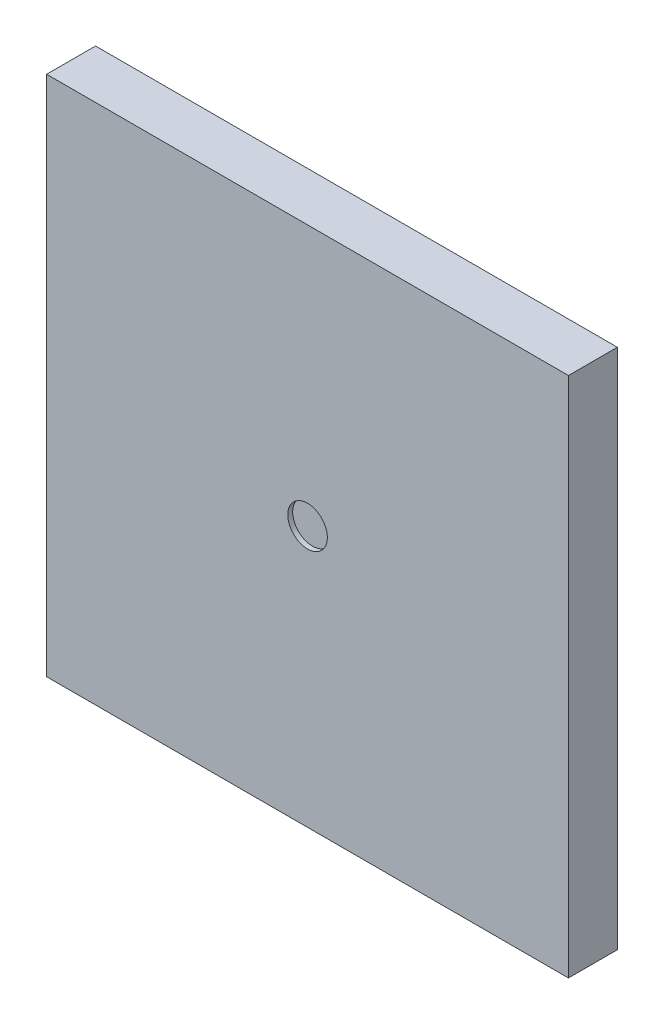
ISO-10303-21;
HEADER;
FILE_DESCRIPTION(('STEP AP214'),'2;1');
FILE_NAME('part.step','',(''),(''),'','','');
FILE_SCHEMA(('AUTOMOTIVE_DESIGN { 1 0 10303 214 1 1 1 1 }'));
ENDSEC;
DATA;
#1=APPLICATION_CONTEXT('core data for automotive mechanical design processes');
#2=APPLICATION_PROTOCOL_DEFINITION('international standard','automotive_design',2000,#1);
#3=PRODUCT_CONTEXT('',#1,'mechanical');
#4=PRODUCT('Part','Part','',(#3));
#5=PRODUCT_RELATED_PRODUCT_CATEGORY('part','',(#4));
#6=PRODUCT_DEFINITION_FORMATION('','',#4);
#7=PRODUCT_DEFINITION_CONTEXT('part definition',#1,'design');
#8=PRODUCT_DEFINITION('design','',#6,#7);
#9=PRODUCT_DEFINITION_SHAPE('','',#8);
#10=(LENGTH_UNIT() NAMED_UNIT(*) SI_UNIT(.MILLI.,.METRE.));
#11=(NAMED_UNIT(*) PLANE_ANGLE_UNIT() SI_UNIT($,.RADIAN.));
#12=(NAMED_UNIT(*) SI_UNIT($,.STERADIAN.) SOLID_ANGLE_UNIT());
#13=UNCERTAINTY_MEASURE_WITH_UNIT(LENGTH_MEASURE(1.E-05),#10,'distance_accuracy_value','');
#14=(GEOMETRIC_REPRESENTATION_CONTEXT(3) GLOBAL_UNCERTAINTY_ASSIGNED_CONTEXT((#13)) GLOBAL_UNIT_ASSIGNED_CONTEXT((#10,
#11,#12)) REPRESENTATION_CONTEXT('',''));
#15=CARTESIAN_POINT('',(0.,0.,0.));
#16=DIRECTION('',(0.,0.,1.));
#17=DIRECTION('',(1.,0.,0.));
#18=AXIS2_PLACEMENT_3D('',#15,#16,#17);
#19=CARTESIAN_POINT('',(-13.55,13.55,2.54));
#20=DIRECTION('',(1.,0.,0.));
#21=DIRECTION('',(0.,1.,0.));
#22=AXIS2_PLACEMENT_3D('',#19,#20,#21);
#23=PLANE('',#22);
#24=DIRECTION('',(0.,-1.,0.));
#25=VECTOR('',#24,1.);
#26=CARTESIAN_POINT('',(-13.55,13.55,0.));
#27=LINE('',#26,#25);
#28=CARTESIAN_POINT('',(-13.55,13.55,0.));
#29=VERTEX_POINT('',#28);
#30=CARTESIAN_POINT('',(-13.55,-13.55,0.));
#31=VERTEX_POINT('',#30);
#32=EDGE_CURVE('E75',#29,#31,#27,.T.);
#33=ORIENTED_EDGE('',*,*,#32,.T.);
#34=DIRECTION('',(0.,0.,-1.));
#35=VECTOR('',#34,1.);
#36=CARTESIAN_POINT('',(-13.55,-13.55,2.54));
#37=LINE('',#36,#35);
#38=CARTESIAN_POINT('',(-13.55,-13.55,2.54));
#39=VERTEX_POINT('',#38);
#40=EDGE_CURVE('E11',#39,#31,#37,.T.);
#41=ORIENTED_EDGE('',*,*,#40,.F.);
#42=DIRECTION('',(0.,-1.,0.));
#43=VECTOR('',#42,1.);
#44=CARTESIAN_POINT('',(-13.55,13.55,2.54));
#45=LINE('',#44,#43);
#46=CARTESIAN_POINT('',(-13.55,13.55,2.54));
#47=VERTEX_POINT('',#46);
#48=EDGE_CURVE('E98',#47,#39,#45,.T.);
#49=ORIENTED_EDGE('',*,*,#48,.F.);
#50=DIRECTION('',(0.,0.,-1.));
#51=VECTOR('',#50,1.);
#52=CARTESIAN_POINT('',(-13.55,13.55,2.54));
#53=LINE('',#52,#51);
#54=EDGE_CURVE('E87',#47,#29,#53,.T.);
#55=ORIENTED_EDGE('',*,*,#54,.T.);
#56=EDGE_LOOP('',(#33,#41,#49,#55));
#57=FACE_BOUND('',#56,.T.);
#58=ADVANCED_FACE('F31',(#57),#23,.F.);
#59=CARTESIAN_POINT('',(-13.55,-13.55,2.54));
#60=DIRECTION('',(0.,1.,0.));
#61=DIRECTION('',(-1.,0.,0.));
#62=AXIS2_PLACEMENT_3D('',#59,#60,#61);
#63=PLANE('',#62);
#64=DIRECTION('',(1.,0.,0.));
#65=VECTOR('',#64,1.);
#66=CARTESIAN_POINT('',(-13.55,-13.55,0.));
#67=LINE('',#66,#65);
#68=CARTESIAN_POINT('',(13.55,-13.55,0.));
#69=VERTEX_POINT('',#68);
#70=EDGE_CURVE('E71',#31,#69,#67,.T.);
#71=ORIENTED_EDGE('',*,*,#70,.T.);
#72=DIRECTION('',(0.,0.,-1.));
#73=VECTOR('',#72,1.);
#74=CARTESIAN_POINT('',(13.55,-13.55,2.54));
#75=LINE('',#74,#73);
#76=CARTESIAN_POINT('',(13.55,-13.55,2.54));
#77=VERTEX_POINT('',#76);
#78=EDGE_CURVE('E38',#77,#69,#75,.T.);
#79=ORIENTED_EDGE('',*,*,#78,.F.);
#80=DIRECTION('',(1.,0.,0.));
#81=VECTOR('',#80,1.);
#82=CARTESIAN_POINT('',(-13.55,-13.55,2.54));
#83=LINE('',#82,#81);
#84=EDGE_CURVE('E83',#39,#77,#83,.T.);
#85=ORIENTED_EDGE('',*,*,#84,.F.);
#86=ORIENTED_EDGE('',*,*,#40,.T.);
#87=EDGE_LOOP('',(#71,#79,#85,#86));
#88=FACE_BOUND('',#87,.T.);
#89=ADVANCED_FACE('F82',(#88),#63,.F.);
#90=CARTESIAN_POINT('',(13.55,13.55,2.54));
#91=DIRECTION('',(-1.,0.,0.));
#92=DIRECTION('',(0.,-1.,0.));
#93=AXIS2_PLACEMENT_3D('',#90,#91,#92);
#94=PLANE('',#93);
#95=DIRECTION('',(0.,1.,0.));
#96=VECTOR('',#95,1.);
#97=CARTESIAN_POINT('',(13.55,13.55,0.));
#98=LINE('',#97,#96);
#99=CARTESIAN_POINT('',(13.55,13.55,0.));
#100=VERTEX_POINT('',#99);
#101=EDGE_CURVE('E76',#69,#100,#98,.T.);
#102=ORIENTED_EDGE('',*,*,#101,.T.);
#103=DIRECTION('',(0.,0.,-1.));
#104=VECTOR('',#103,1.);
#105=CARTESIAN_POINT('',(13.55,13.55,2.54));
#106=LINE('',#105,#104);
#107=CARTESIAN_POINT('',(13.55,13.55,2.54));
#108=VERTEX_POINT('',#107);
#109=EDGE_CURVE('E104',#108,#100,#106,.T.);
#110=ORIENTED_EDGE('',*,*,#109,.F.);
#111=DIRECTION('',(0.,1.,0.));
#112=VECTOR('',#111,1.);
#113=CARTESIAN_POINT('',(13.55,13.55,2.54));
#114=LINE('',#113,#112);
#115=EDGE_CURVE('E50',#77,#108,#114,.T.);
#116=ORIENTED_EDGE('',*,*,#115,.F.);
#117=ORIENTED_EDGE('',*,*,#78,.T.);
#118=EDGE_LOOP('',(#102,#110,#116,#117));
#119=FACE_BOUND('',#118,.T.);
#120=ADVANCED_FACE('F107',(#119),#94,.F.);
#121=CARTESIAN_POINT('',(-13.55,13.55,2.54));
#122=DIRECTION('',(0.,-1.,0.));
#123=DIRECTION('',(1.,0.,0.));
#124=AXIS2_PLACEMENT_3D('',#121,#122,#123);
#125=PLANE('',#124);
#126=DIRECTION('',(-1.,0.,0.));
#127=VECTOR('',#126,1.);
#128=CARTESIAN_POINT('',(-13.55,13.55,0.));
#129=LINE('',#128,#127);
#130=EDGE_CURVE('E96',#100,#29,#129,.T.);
#131=ORIENTED_EDGE('',*,*,#130,.T.);
#132=ORIENTED_EDGE('',*,*,#54,.F.);
#133=DIRECTION('',(-1.,0.,0.));
#134=VECTOR('',#133,1.);
#135=CARTESIAN_POINT('',(-13.55,13.55,2.54));
#136=LINE('',#135,#134);
#137=EDGE_CURVE('E45',#108,#47,#136,.T.);
#138=ORIENTED_EDGE('',*,*,#137,.F.);
#139=ORIENTED_EDGE('',*,*,#109,.T.);
#140=EDGE_LOOP('',(#131,#132,#138,#139));
#141=FACE_BOUND('',#140,.T.);
#142=ADVANCED_FACE('F109',(#141),#125,.F.);
#143=CARTESIAN_POINT('',(-13.55,-13.55,2.54));
#144=DIRECTION('',(0.,0.,1.));
#145=DIRECTION('',(1.,0.,0.));
#146=AXIS2_PLACEMENT_3D('',#143,#144,#145);
#147=PLANE('',#146);
#148=CARTESIAN_POINT('',(0.,0.,2.54));
#149=DIRECTION('',(0.,0.,1.));
#150=DIRECTION('',(1.,0.,0.));
#151=AXIS2_PLACEMENT_3D('',#148,#149,#150);
#152=CIRCLE('',#151,1.02820863019791);
#153=CARTESIAN_POINT('',(1.02820863019791,0.,2.54));
#154=VERTEX_POINT('',#153);
#155=EDGE_CURVE('E91',#154,#154,#152,.T.);
#156=ORIENTED_EDGE('',*,*,#155,.F.);
#157=EDGE_LOOP('',(#156));
#158=FACE_BOUND('',#157,.T.);
#159=ORIENTED_EDGE('',*,*,#48,.T.);
#160=ORIENTED_EDGE('',*,*,#84,.T.);
#161=ORIENTED_EDGE('',*,*,#115,.T.);
#162=ORIENTED_EDGE('',*,*,#137,.T.);
#163=EDGE_LOOP('',(#159,#160,#161,#162));
#164=FACE_BOUND('',#163,.T.);
#165=ADVANCED_FACE('F110',(#158,#164),#147,.T.);
#166=CARTESIAN_POINT('',(-13.55,-13.55,0.));
#167=DIRECTION('',(0.,0.,1.));
#168=DIRECTION('',(1.,0.,0.));
#169=AXIS2_PLACEMENT_3D('',#166,#167,#168);
#170=PLANE('',#169);
#171=ORIENTED_EDGE('',*,*,#32,.F.);
#172=ORIENTED_EDGE('',*,*,#130,.F.);
#173=ORIENTED_EDGE('',*,*,#101,.F.);
#174=ORIENTED_EDGE('',*,*,#70,.F.);
#175=EDGE_LOOP('',(#171,#172,#173,#174));
#176=FACE_BOUND('',#175,.T.);
#177=ADVANCED_FACE('F72',(#176),#170,.F.);
#178=CARTESIAN_POINT('',(0.,0.,2.286));
#179=DIRECTION('',(0.,0.,1.));
#180=DIRECTION('',(1.,0.,0.));
#181=AXIS2_PLACEMENT_3D('',#178,#179,#180);
#182=CYLINDRICAL_SURFACE('',#181,1.02820863019791);
#183=CARTESIAN_POINT('',(0.,0.,2.286));
#184=DIRECTION('',(0.,0.,1.));
#185=DIRECTION('',(1.,0.,0.));
#186=AXIS2_PLACEMENT_3D('',#183,#184,#185);
#187=CIRCLE('',#186,1.02820863019791);
#188=CARTESIAN_POINT('',(1.02820863019791,0.,2.286));
#189=VERTEX_POINT('',#188);
#190=EDGE_CURVE('E88',#189,#189,#187,.T.);
#191=ORIENTED_EDGE('',*,*,#190,.F.);
#192=EDGE_LOOP('',(#191));
#193=FACE_BOUND('',#192,.T.);
#194=ORIENTED_EDGE('',*,*,#155,.T.);
#195=EDGE_LOOP('',(#194));
#196=FACE_BOUND('',#195,.T.);
#197=ADVANCED_FACE('F118',(#193,#196),#182,.F.);
#198=CARTESIAN_POINT('',(0.,0.,2.286));
#199=DIRECTION('',(0.,0.,1.));
#200=DIRECTION('',(1.,0.,0.));
#201=AXIS2_PLACEMENT_3D('',#198,#199,#200);
#202=PLANE('',#201);
#203=ORIENTED_EDGE('',*,*,#190,.T.);
#204=EDGE_LOOP('',(#203));
#205=FACE_BOUND('',#204,.T.);
#206=ADVANCED_FACE('F155',(#205),#202,.T.);
#207=CLOSED_SHELL('',(#58,#89,#120,#142,#165,#177,#197,#206));
#208=MANIFOLD_SOLID_BREP('B2',#207);
#209=ADVANCED_BREP_SHAPE_REPRESENTATION('',(#18,#208),#14);
#210=SHAPE_DEFINITION_REPRESENTATION(#9,#209);
ENDSEC;
END-ISO-10303-21;
